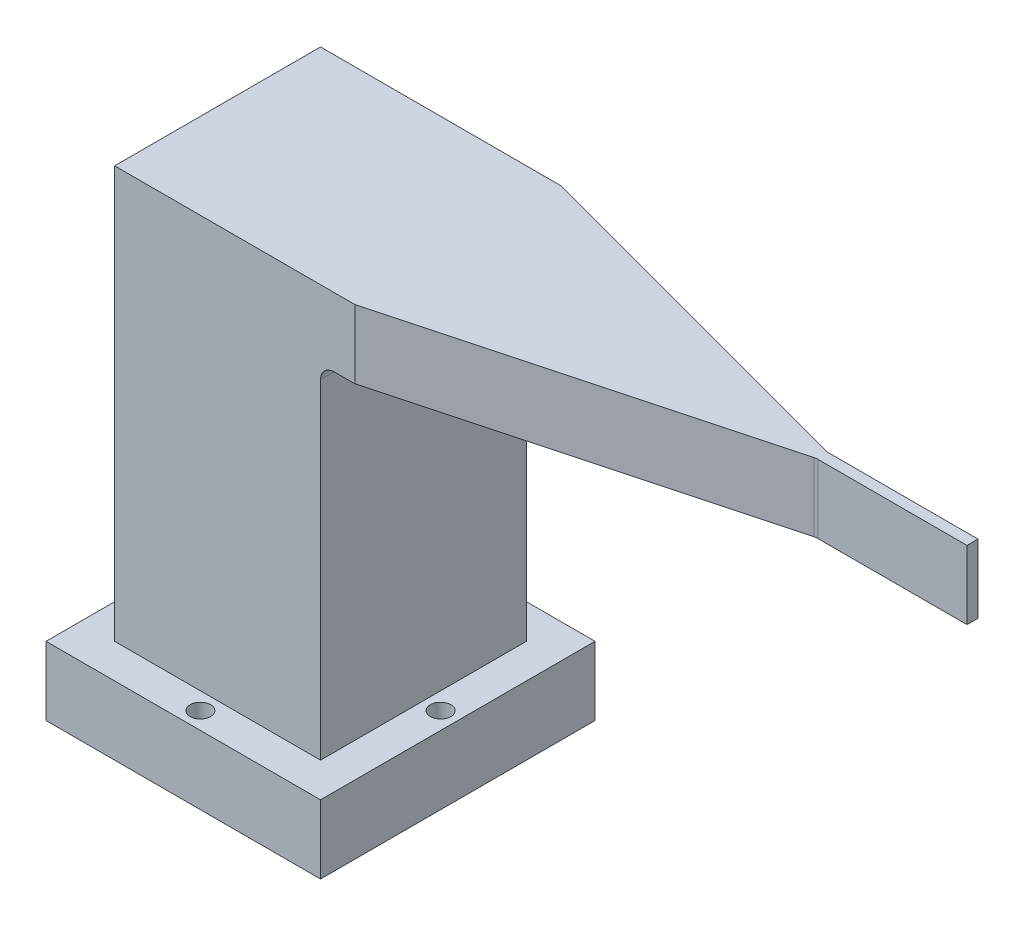
ISO-10303-21;
HEADER;
FILE_DESCRIPTION(('STEP AP214'),'2;1');
FILE_NAME('part.step','',(''),(''),'','','');
FILE_SCHEMA(('AUTOMOTIVE_DESIGN { 1 0 10303 214 1 1 1 1 }'));
ENDSEC;
DATA;
#1=APPLICATION_CONTEXT('core data for automotive mechanical design processes');
#2=APPLICATION_PROTOCOL_DEFINITION('international standard','automotive_design',2000,#1);
#3=PRODUCT_CONTEXT('',#1,'mechanical');
#4=PRODUCT('Part','Part','',(#3));
#5=PRODUCT_RELATED_PRODUCT_CATEGORY('part','',(#4));
#6=PRODUCT_DEFINITION_FORMATION('','',#4);
#7=PRODUCT_DEFINITION_CONTEXT('part definition',#1,'design');
#8=PRODUCT_DEFINITION('design','',#6,#7);
#9=PRODUCT_DEFINITION_SHAPE('','',#8);
#10=(LENGTH_UNIT() NAMED_UNIT(*) SI_UNIT(.MILLI.,.METRE.));
#11=(NAMED_UNIT(*) PLANE_ANGLE_UNIT() SI_UNIT($,.RADIAN.));
#12=(NAMED_UNIT(*) SI_UNIT($,.STERADIAN.) SOLID_ANGLE_UNIT());
#13=UNCERTAINTY_MEASURE_WITH_UNIT(LENGTH_MEASURE(1.E-05),#10,'distance_accuracy_value','');
#14=(GEOMETRIC_REPRESENTATION_CONTEXT(3) GLOBAL_UNCERTAINTY_ASSIGNED_CONTEXT((#13)) GLOBAL_UNIT_ASSIGNED_CONTEXT((#10,
#11,#12)) REPRESENTATION_CONTEXT('',''));
#15=CARTESIAN_POINT('',(0.,0.,0.));
#16=DIRECTION('',(0.,0.,1.));
#17=DIRECTION('',(1.,0.,0.));
#18=AXIS2_PLACEMENT_3D('',#15,#16,#17);
#19=CARTESIAN_POINT('',(7.5,35.,-7.5));
#20=DIRECTION('',(1.,0.,0.));
#21=DIRECTION('',(0.,0.,-1.));
#22=AXIS2_PLACEMENT_3D('',#19,#20,#21);
#23=PLANE('',#22);
#24=DIRECTION('',(0.,-1.,0.));
#25=VECTOR('',#24,1.);
#26=CARTESIAN_POINT('',(7.5,35.,-7.5));
#27=LINE('',#26,#25);
#28=CARTESIAN_POINT('',(7.5,29.,-7.5));
#29=VERTEX_POINT('',#28);
#30=CARTESIAN_POINT('',(7.5,5.,-7.5));
#31=VERTEX_POINT('',#30);
#32=EDGE_CURVE('E193',#29,#31,#27,.T.);
#33=ORIENTED_EDGE('',*,*,#32,.F.);
#34=DIRECTION('',(0.,0.,-1.));
#35=VECTOR('',#34,1.);
#36=CARTESIAN_POINT('',(7.5,29.,-7.5));
#37=LINE('',#36,#35);
#38=CARTESIAN_POINT('',(7.5,29.,7.5));
#39=VERTEX_POINT('',#38);
#40=EDGE_CURVE('E239',#29,#39,#37,.F.);
#41=ORIENTED_EDGE('',*,*,#40,.T.);
#42=DIRECTION('',(0.,-1.,0.));
#43=VECTOR('',#42,1.);
#44=CARTESIAN_POINT('',(7.5,35.,7.5));
#45=LINE('',#44,#43);
#46=CARTESIAN_POINT('',(7.5,5.,7.5));
#47=VERTEX_POINT('',#46);
#48=EDGE_CURVE('E191',#39,#47,#45,.T.);
#49=ORIENTED_EDGE('',*,*,#48,.T.);
#50=DIRECTION('',(0.,0.,-1.));
#51=VECTOR('',#50,1.);
#52=CARTESIAN_POINT('',(7.5,5.,0.));
#53=LINE('',#52,#51);
#54=EDGE_CURVE('E197',#47,#31,#53,.T.);
#55=ORIENTED_EDGE('',*,*,#54,.T.);
#56=EDGE_LOOP('',(#33,#41,#49,#55));
#57=FACE_BOUND('',#56,.T.);
#58=ADVANCED_FACE('F33',(#57),#23,.T.);
#59=CARTESIAN_POINT('',(-10.,5.,10.));
#60=DIRECTION('',(1.,0.,0.));
#61=DIRECTION('',(0.,0.,-1.));
#62=AXIS2_PLACEMENT_3D('',#59,#60,#61);
#63=PLANE('',#62);
#64=DIRECTION('',(0.,0.,1.));
#65=VECTOR('',#64,1.);
#66=CARTESIAN_POINT('',(-10.,0.,10.));
#67=LINE('',#66,#65);
#68=CARTESIAN_POINT('',(-10.,0.,-10.));
#69=VERTEX_POINT('',#68);
#70=CARTESIAN_POINT('',(-10.,0.,10.));
#71=VERTEX_POINT('',#70);
#72=EDGE_CURVE('E206',#69,#71,#67,.T.);
#73=ORIENTED_EDGE('',*,*,#72,.T.);
#74=DIRECTION('',(0.,-1.,0.));
#75=VECTOR('',#74,1.);
#76=CARTESIAN_POINT('',(-10.,5.,10.));
#77=LINE('',#76,#75);
#78=CARTESIAN_POINT('',(-10.,5.,10.));
#79=VERTEX_POINT('',#78);
#80=EDGE_CURVE('E233',#79,#71,#77,.T.);
#81=ORIENTED_EDGE('',*,*,#80,.F.);
#82=DIRECTION('',(0.,0.,1.));
#83=VECTOR('',#82,1.);
#84=CARTESIAN_POINT('',(-10.,5.,10.));
#85=LINE('',#84,#83);
#86=CARTESIAN_POINT('',(-10.,5.,-10.));
#87=VERTEX_POINT('',#86);
#88=EDGE_CURVE('E207',#87,#79,#85,.T.);
#89=ORIENTED_EDGE('',*,*,#88,.F.);
#90=DIRECTION('',(0.,-1.,0.));
#91=VECTOR('',#90,1.);
#92=CARTESIAN_POINT('',(-10.,5.,-10.));
#93=LINE('',#92,#91);
#94=EDGE_CURVE('E217',#87,#69,#93,.T.);
#95=ORIENTED_EDGE('',*,*,#94,.T.);
#96=EDGE_LOOP('',(#73,#81,#89,#95));
#97=FACE_BOUND('',#96,.T.);
#98=ADVANCED_FACE('F281',(#97),#63,.F.);
#99=CARTESIAN_POINT('',(10.,5.,10.));
#100=DIRECTION('',(0.,0.,-1.));
#101=DIRECTION('',(-1.,0.,0.));
#102=AXIS2_PLACEMENT_3D('',#99,#100,#101);
#103=PLANE('',#102);
#104=DIRECTION('',(1.,0.,0.));
#105=VECTOR('',#104,1.);
#106=CARTESIAN_POINT('',(10.,0.,10.));
#107=LINE('',#106,#105);
#108=CARTESIAN_POINT('',(10.,0.,10.));
#109=VERTEX_POINT('',#108);
#110=EDGE_CURVE('E220',#71,#109,#107,.T.);
#111=ORIENTED_EDGE('',*,*,#110,.T.);
#112=DIRECTION('',(0.,-1.,0.));
#113=VECTOR('',#112,1.);
#114=CARTESIAN_POINT('',(10.,5.,10.));
#115=LINE('',#114,#113);
#116=CARTESIAN_POINT('',(10.,5.,10.));
#117=VERTEX_POINT('',#116);
#118=EDGE_CURVE('E230',#117,#109,#115,.T.);
#119=ORIENTED_EDGE('',*,*,#118,.F.);
#120=DIRECTION('',(1.,0.,0.));
#121=VECTOR('',#120,1.);
#122=CARTESIAN_POINT('',(10.,5.,10.));
#123=LINE('',#122,#121);
#124=EDGE_CURVE('E210',#79,#117,#123,.T.);
#125=ORIENTED_EDGE('',*,*,#124,.F.);
#126=ORIENTED_EDGE('',*,*,#80,.T.);
#127=EDGE_LOOP('',(#111,#119,#125,#126));
#128=FACE_BOUND('',#127,.T.);
#129=ADVANCED_FACE('F287',(#128),#103,.F.);
#130=CARTESIAN_POINT('',(10.,5.,10.));
#131=DIRECTION('',(-1.,0.,0.));
#132=DIRECTION('',(0.,0.,1.));
#133=AXIS2_PLACEMENT_3D('',#130,#131,#132);
#134=PLANE('',#133);
#135=DIRECTION('',(0.,0.,-1.));
#136=VECTOR('',#135,1.);
#137=CARTESIAN_POINT('',(10.,0.,10.));
#138=LINE('',#137,#136);
#139=CARTESIAN_POINT('',(10.,0.,-10.));
#140=VERTEX_POINT('',#139);
#141=EDGE_CURVE('E222',#109,#140,#138,.T.);
#142=ORIENTED_EDGE('',*,*,#141,.T.);
#143=DIRECTION('',(0.,-1.,0.));
#144=VECTOR('',#143,1.);
#145=CARTESIAN_POINT('',(10.,5.,-10.));
#146=LINE('',#145,#144);
#147=CARTESIAN_POINT('',(10.,5.,-10.));
#148=VERTEX_POINT('',#147);
#149=EDGE_CURVE('E227',#148,#140,#146,.T.);
#150=ORIENTED_EDGE('',*,*,#149,.F.);
#151=DIRECTION('',(0.,0.,-1.));
#152=VECTOR('',#151,1.);
#153=CARTESIAN_POINT('',(10.,5.,10.));
#154=LINE('',#153,#152);
#155=EDGE_CURVE('E213',#117,#148,#154,.T.);
#156=ORIENTED_EDGE('',*,*,#155,.F.);
#157=ORIENTED_EDGE('',*,*,#118,.T.);
#158=EDGE_LOOP('',(#142,#150,#156,#157));
#159=FACE_BOUND('',#158,.T.);
#160=ADVANCED_FACE('F312',(#159),#134,.F.);
#161=CARTESIAN_POINT('',(10.,5.,-10.));
#162=DIRECTION('',(0.,0.,1.));
#163=DIRECTION('',(1.,0.,0.));
#164=AXIS2_PLACEMENT_3D('',#161,#162,#163);
#165=PLANE('',#164);
#166=DIRECTION('',(-1.,0.,0.));
#167=VECTOR('',#166,1.);
#168=CARTESIAN_POINT('',(10.,0.,-10.));
#169=LINE('',#168,#167);
#170=EDGE_CURVE('E211',#140,#69,#169,.T.);
#171=ORIENTED_EDGE('',*,*,#170,.T.);
#172=ORIENTED_EDGE('',*,*,#94,.F.);
#173=DIRECTION('',(-1.,0.,0.));
#174=VECTOR('',#173,1.);
#175=CARTESIAN_POINT('',(10.,5.,-10.));
#176=LINE('',#175,#174);
#177=EDGE_CURVE('E215',#148,#87,#176,.T.);
#178=ORIENTED_EDGE('',*,*,#177,.F.);
#179=ORIENTED_EDGE('',*,*,#149,.T.);
#180=EDGE_LOOP('',(#171,#172,#178,#179));
#181=FACE_BOUND('',#180,.T.);
#182=ADVANCED_FACE('F305',(#181),#165,.F.);
#183=CARTESIAN_POINT('',(0.,5.,0.));
#184=DIRECTION('',(0.,1.,0.));
#185=DIRECTION('',(0.,0.,1.));
#186=AXIS2_PLACEMENT_3D('',#183,#184,#185);
#187=PLANE('',#186);
#188=CARTESIAN_POINT('',(-8.75,5.,0.));
#189=DIRECTION('',(0.,1.,0.));
#190=DIRECTION('',(0.,0.,1.));
#191=AXIS2_PLACEMENT_3D('',#188,#189,#190);
#192=CIRCLE('',#191,0.75);
#193=CARTESIAN_POINT('',(-8.75,5.,0.75));
#194=VERTEX_POINT('',#193);
#195=EDGE_CURVE('E547',#194,#194,#192,.T.);
#196=ORIENTED_EDGE('',*,*,#195,.F.);
#197=EDGE_LOOP('',(#196));
#198=FACE_BOUND('',#197,.T.);
#199=CARTESIAN_POINT('',(0.,5.,-8.75));
#200=DIRECTION('',(0.,1.,0.));
#201=DIRECTION('',(0.,0.,1.));
#202=AXIS2_PLACEMENT_3D('',#199,#200,#201);
#203=CIRCLE('',#202,0.75);
#204=CARTESIAN_POINT('',(0.,5.,-8.));
#205=VERTEX_POINT('',#204);
#206=EDGE_CURVE('E553',#205,#205,#203,.T.);
#207=ORIENTED_EDGE('',*,*,#206,.F.);
#208=EDGE_LOOP('',(#207));
#209=FACE_BOUND('',#208,.T.);
#210=CARTESIAN_POINT('',(8.75,5.,0.));
#211=DIRECTION('',(0.,1.,0.));
#212=DIRECTION('',(0.,0.,1.));
#213=AXIS2_PLACEMENT_3D('',#210,#211,#212);
#214=CIRCLE('',#213,0.750000000000001);
#215=CARTESIAN_POINT('',(8.75,5.,0.750000000000062));
#216=VERTEX_POINT('',#215);
#217=EDGE_CURVE('E559',#216,#216,#214,.T.);
#218=ORIENTED_EDGE('',*,*,#217,.F.);
#219=EDGE_LOOP('',(#218));
#220=FACE_BOUND('',#219,.T.);
#221=CARTESIAN_POINT('',(0.,5.,8.75));
#222=DIRECTION('',(0.,1.,0.));
#223=DIRECTION('',(0.,0.,1.));
#224=AXIS2_PLACEMENT_3D('',#221,#222,#223);
#225=CIRCLE('',#224,0.75);
#226=CARTESIAN_POINT('',(0.,5.,9.5));
#227=VERTEX_POINT('',#226);
#228=EDGE_CURVE('E546',#227,#227,#225,.T.);
#229=ORIENTED_EDGE('',*,*,#228,.F.);
#230=EDGE_LOOP('',(#229));
#231=FACE_BOUND('',#230,.T.);
#232=DIRECTION('',(0.,0.,1.));
#233=VECTOR('',#232,1.);
#234=CARTESIAN_POINT('',(-7.5,5.,0.));
#235=LINE('',#234,#233);
#236=CARTESIAN_POINT('',(-7.5,5.,-7.5));
#237=VERTEX_POINT('',#236);
#238=CARTESIAN_POINT('',(-7.5,5.,7.5));
#239=VERTEX_POINT('',#238);
#240=EDGE_CURVE('E203',#237,#239,#235,.T.);
#241=ORIENTED_EDGE('',*,*,#240,.F.);
#242=DIRECTION('',(-1.,0.,0.));
#243=VECTOR('',#242,1.);
#244=CARTESIAN_POINT('',(0.,5.,-7.5));
#245=LINE('',#244,#243);
#246=EDGE_CURVE('E190',#31,#237,#245,.T.);
#247=ORIENTED_EDGE('',*,*,#246,.F.);
#248=ORIENTED_EDGE('',*,*,#54,.F.);
#249=DIRECTION('',(1.,0.,0.));
#250=VECTOR('',#249,1.);
#251=CARTESIAN_POINT('',(0.,5.,7.5));
#252=LINE('',#251,#250);
#253=EDGE_CURVE('E200',#239,#47,#252,.T.);
#254=ORIENTED_EDGE('',*,*,#253,.F.);
#255=EDGE_LOOP('',(#241,#247,#248,#254));
#256=FACE_BOUND('',#255,.T.);
#257=ORIENTED_EDGE('',*,*,#88,.T.);
#258=ORIENTED_EDGE('',*,*,#124,.T.);
#259=ORIENTED_EDGE('',*,*,#155,.T.);
#260=ORIENTED_EDGE('',*,*,#177,.T.);
#261=EDGE_LOOP('',(#257,#258,#259,#260));
#262=FACE_BOUND('',#261,.T.);
#263=ADVANCED_FACE('F302',(#198,#209,#220,#231,#256,#262),#187,.T.);
#264=CARTESIAN_POINT('',(0.,0.,0.));
#265=DIRECTION('',(0.,1.,0.));
#266=DIRECTION('',(0.,0.,1.));
#267=AXIS2_PLACEMENT_3D('',#264,#265,#266);
#268=PLANE('',#267);
#269=CARTESIAN_POINT('',(-8.75,0.,0.));
#270=DIRECTION('',(0.,1.,0.));
#271=DIRECTION('',(0.,0.,1.));
#272=AXIS2_PLACEMENT_3D('',#269,#270,#271);
#273=CIRCLE('',#272,0.75);
#274=CARTESIAN_POINT('',(-8.75,0.,0.75));
#275=VERTEX_POINT('',#274);
#276=EDGE_CURVE('E183',#275,#275,#273,.F.);
#277=ORIENTED_EDGE('',*,*,#276,.F.);
#278=EDGE_LOOP('',(#277));
#279=FACE_BOUND('',#278,.T.);
#280=CARTESIAN_POINT('',(0.,0.,-8.75));
#281=DIRECTION('',(0.,1.,0.));
#282=DIRECTION('',(0.,0.,1.));
#283=AXIS2_PLACEMENT_3D('',#280,#281,#282);
#284=CIRCLE('',#283,0.75);
#285=CARTESIAN_POINT('',(0.,0.,-8.));
#286=VERTEX_POINT('',#285);
#287=EDGE_CURVE('E550',#286,#286,#284,.F.);
#288=ORIENTED_EDGE('',*,*,#287,.F.);
#289=EDGE_LOOP('',(#288));
#290=FACE_BOUND('',#289,.T.);
#291=CARTESIAN_POINT('',(8.75,0.,0.));
#292=DIRECTION('',(0.,1.,0.));
#293=DIRECTION('',(0.,0.,1.));
#294=AXIS2_PLACEMENT_3D('',#291,#292,#293);
#295=CIRCLE('',#294,0.750000000000001);
#296=CARTESIAN_POINT('',(8.75,0.,0.750000000000062));
#297=VERTEX_POINT('',#296);
#298=EDGE_CURVE('E556',#297,#297,#295,.F.);
#299=ORIENTED_EDGE('',*,*,#298,.F.);
#300=EDGE_LOOP('',(#299));
#301=FACE_BOUND('',#300,.T.);
#302=CARTESIAN_POINT('',(0.,0.,8.75));
#303=DIRECTION('',(0.,1.,0.));
#304=DIRECTION('',(0.,0.,1.));
#305=AXIS2_PLACEMENT_3D('',#302,#303,#304);
#306=CIRCLE('',#305,0.75);
#307=CARTESIAN_POINT('',(0.,0.,9.5));
#308=VERTEX_POINT('',#307);
#309=EDGE_CURVE('E562',#308,#308,#306,.F.);
#310=ORIENTED_EDGE('',*,*,#309,.F.);
#311=EDGE_LOOP('',(#310));
#312=FACE_BOUND('',#311,.T.);
#313=ORIENTED_EDGE('',*,*,#72,.F.);
#314=ORIENTED_EDGE('',*,*,#170,.F.);
#315=ORIENTED_EDGE('',*,*,#141,.F.);
#316=ORIENTED_EDGE('',*,*,#110,.F.);
#317=EDGE_LOOP('',(#313,#314,#315,#316));
#318=FACE_BOUND('',#317,.T.);
#319=ADVANCED_FACE('F300',(#279,#290,#301,#312,#318),#268,.F.);
#320=CARTESIAN_POINT('',(-7.5,35.,-7.5));
#321=DIRECTION('',(-1.,0.,0.));
#322=DIRECTION('',(0.,0.,1.));
#323=AXIS2_PLACEMENT_3D('',#320,#321,#322);
#324=PLANE('',#323);
#325=DIRECTION('',(0.,-1.,0.));
#326=VECTOR('',#325,1.);
#327=CARTESIAN_POINT('',(-7.5,35.,-7.5));
#328=LINE('',#327,#326);
#329=CARTESIAN_POINT('',(-7.5,35.,-7.5));
#330=VERTEX_POINT('',#329);
#331=EDGE_CURVE('E178',#330,#237,#328,.T.);
#332=ORIENTED_EDGE('',*,*,#331,.T.);
#333=ORIENTED_EDGE('',*,*,#240,.T.);
#334=DIRECTION('',(0.,-1.,0.));
#335=VECTOR('',#334,1.);
#336=CARTESIAN_POINT('',(-7.5,35.,7.5));
#337=LINE('',#336,#335);
#338=CARTESIAN_POINT('',(-7.5,35.,7.5));
#339=VERTEX_POINT('',#338);
#340=EDGE_CURVE('E187',#339,#239,#337,.T.);
#341=ORIENTED_EDGE('',*,*,#340,.F.);
#342=DIRECTION('',(0.,0.,-1.));
#343=VECTOR('',#342,1.);
#344=CARTESIAN_POINT('',(-7.5,35.,-7.5));
#345=LINE('',#344,#343);
#346=EDGE_CURVE('E180',#339,#330,#345,.T.);
#347=ORIENTED_EDGE('',*,*,#346,.T.);
#348=EDGE_LOOP('',(#332,#333,#341,#347));
#349=FACE_BOUND('',#348,.T.);
#350=ADVANCED_FACE('F297',(#349),#324,.T.);
#351=CARTESIAN_POINT('',(7.5,35.,7.5));
#352=DIRECTION('',(0.,0.,1.));
#353=DIRECTION('',(1.,0.,0.));
#354=AXIS2_PLACEMENT_3D('',#351,#352,#353);
#355=PLANE('',#354);
#356=DIRECTION('',(0.,1.,0.));
#357=VECTOR('',#356,1.);
#358=CARTESIAN_POINT('',(10.,-8.16621542673572,7.5));
#359=LINE('',#358,#357);
#360=CARTESIAN_POINT('',(10.,30.,7.5));
#361=VERTEX_POINT('',#360);
#362=CARTESIAN_POINT('',(10.,35.,7.5));
#363=VERTEX_POINT('',#362);
#364=EDGE_CURVE('E522',#361,#363,#359,.T.);
#365=ORIENTED_EDGE('',*,*,#364,.T.);
#366=DIRECTION('',(-1.,0.,0.));
#367=VECTOR('',#366,1.);
#368=CARTESIAN_POINT('',(7.5,35.,7.5));
#369=LINE('',#368,#367);
#370=EDGE_CURVE('E179',#363,#339,#369,.T.);
#371=ORIENTED_EDGE('',*,*,#370,.T.);
#372=ORIENTED_EDGE('',*,*,#340,.T.);
#373=ORIENTED_EDGE('',*,*,#253,.T.);
#374=ORIENTED_EDGE('',*,*,#48,.F.);
#375=CARTESIAN_POINT('',(8.5,29.,7.5));
#376=DIRECTION('',(0.,0.,1.));
#377=DIRECTION('',(1.,0.,0.));
#378=AXIS2_PLACEMENT_3D('',#375,#376,#377);
#379=CIRCLE('',#378,1.);
#380=CARTESIAN_POINT('',(8.5,30.,7.5));
#381=VERTEX_POINT('',#380);
#382=EDGE_CURVE('E252',#39,#381,#379,.F.);
#383=ORIENTED_EDGE('',*,*,#382,.T.);
#384=DIRECTION('',(-1.,0.,0.));
#385=VECTOR('',#384,1.);
#386=CARTESIAN_POINT('',(47.5,30.,7.5));
#387=LINE('',#386,#385);
#388=EDGE_CURVE('E544',#361,#381,#387,.T.);
#389=ORIENTED_EDGE('',*,*,#388,.F.);
#390=EDGE_LOOP('',(#365,#371,#372,#373,#374,#383,#389));
#391=FACE_BOUND('',#390,.T.);
#392=ADVANCED_FACE('F293',(#391),#355,.T.);
#393=CARTESIAN_POINT('',(7.5,35.,-7.5));
#394=DIRECTION('',(0.,0.,-1.));
#395=DIRECTION('',(-1.,0.,0.));
#396=AXIS2_PLACEMENT_3D('',#393,#394,#395);
#397=PLANE('',#396);
#398=DIRECTION('',(0.,1.,0.));
#399=VECTOR('',#398,1.);
#400=CARTESIAN_POINT('',(10.,-8.16621542673572,-7.5));
#401=LINE('',#400,#399);
#402=CARTESIAN_POINT('',(10.,30.,-7.5));
#403=VERTEX_POINT('',#402);
#404=CARTESIAN_POINT('',(10.,35.,-7.5));
#405=VERTEX_POINT('',#404);
#406=EDGE_CURVE('E151',#403,#405,#401,.T.);
#407=ORIENTED_EDGE('',*,*,#406,.F.);
#408=DIRECTION('',(-1.,0.,0.));
#409=VECTOR('',#408,1.);
#410=CARTESIAN_POINT('',(47.5,30.,-7.5));
#411=LINE('',#410,#409);
#412=CARTESIAN_POINT('',(8.5,30.,-7.5));
#413=VERTEX_POINT('',#412);
#414=EDGE_CURVE('E542',#403,#413,#411,.T.);
#415=ORIENTED_EDGE('',*,*,#414,.T.);
#416=CARTESIAN_POINT('',(8.5,29.,-7.5));
#417=DIRECTION('',(0.,0.,-1.));
#418=DIRECTION('',(-1.,0.,0.));
#419=AXIS2_PLACEMENT_3D('',#416,#417,#418);
#420=CIRCLE('',#419,1.);
#421=EDGE_CURVE('E250',#413,#29,#420,.F.);
#422=ORIENTED_EDGE('',*,*,#421,.T.);
#423=ORIENTED_EDGE('',*,*,#32,.T.);
#424=ORIENTED_EDGE('',*,*,#246,.T.);
#425=ORIENTED_EDGE('',*,*,#331,.F.);
#426=DIRECTION('',(1.,0.,0.));
#427=VECTOR('',#426,1.);
#428=CARTESIAN_POINT('',(7.5,35.,-7.5));
#429=LINE('',#428,#427);
#430=EDGE_CURVE('E169',#330,#405,#429,.T.);
#431=ORIENTED_EDGE('',*,*,#430,.T.);
#432=EDGE_LOOP('',(#407,#415,#422,#423,#424,#425,#431));
#433=FACE_BOUND('',#432,.T.);
#434=ADVANCED_FACE('F175',(#433),#397,.T.);
#435=CARTESIAN_POINT('',(0.,35.,0.));
#436=DIRECTION('',(0.,-1.,0.));
#437=DIRECTION('',(0.,0.,-1.));
#438=AXIS2_PLACEMENT_3D('',#435,#436,#437);
#439=PLANE('',#438);
#440=DIRECTION('',(0.,0.,1.));
#441=VECTOR('',#440,1.);
#442=CARTESIAN_POINT('',(47.5,35.,7.5));
#443=LINE('',#442,#441);
#444=CARTESIAN_POINT('',(47.5,35.,-0.4));
#445=VERTEX_POINT('',#444);
#446=CARTESIAN_POINT('',(47.5,35.,0.4));
#447=VERTEX_POINT('',#446);
#448=EDGE_CURVE('E540',#445,#447,#443,.T.);
#449=ORIENTED_EDGE('',*,*,#448,.F.);
#450=DIRECTION('',(1.,0.,0.));
#451=VECTOR('',#450,1.);
#452=CARTESIAN_POINT('',(36.497560733739,35.,-0.4));
#453=LINE('',#452,#451);
#454=CARTESIAN_POINT('',(36.6292132313263,35.,-0.4));
#455=VERTEX_POINT('',#454);
#456=EDGE_CURVE('E163',#455,#445,#453,.T.);
#457=ORIENTED_EDGE('',*,*,#456,.F.);
#458=CARTESIAN_POINT('',(36.6292132313263,35.,-1.4));
#459=DIRECTION('',(0.,-1.,0.));
#460=DIRECTION('',(0.,0.,-1.));
#461=AXIS2_PLACEMENT_3D('',#458,#459,#460);
#462=CIRCLE('',#461,1.);
#463=CARTESIAN_POINT('',(36.3703941862238,35.,-0.434074173710931));
#464=VERTEX_POINT('',#463);
#465=EDGE_CURVE('E172',#455,#464,#462,.T.);
#466=ORIENTED_EDGE('',*,*,#465,.T.);
#467=DIRECTION('',(0.965925826289068,0.,0.258819045102522));
#468=VECTOR('',#467,1.);
#469=CARTESIAN_POINT('',(10.,35.,-7.5));
#470=LINE('',#469,#468);
#471=EDGE_CURVE('E154',#405,#464,#470,.T.);
#472=ORIENTED_EDGE('',*,*,#471,.F.);
#473=ORIENTED_EDGE('',*,*,#430,.F.);
#474=ORIENTED_EDGE('',*,*,#346,.F.);
#475=ORIENTED_EDGE('',*,*,#370,.F.);
#476=DIRECTION('',(-0.965925826289068,0.,0.258819045102522));
#477=VECTOR('',#476,1.);
#478=CARTESIAN_POINT('',(10.,35.,7.5));
#479=LINE('',#478,#477);
#480=CARTESIAN_POINT('',(36.3703941862238,35.,0.434074173710931));
#481=VERTEX_POINT('',#480);
#482=EDGE_CURVE('E523',#481,#363,#479,.T.);
#483=ORIENTED_EDGE('',*,*,#482,.F.);
#484=CARTESIAN_POINT('',(36.6292132313263,35.,1.4));
#485=DIRECTION('',(0.,-1.,0.));
#486=DIRECTION('',(0.,0.,-1.));
#487=AXIS2_PLACEMENT_3D('',#484,#485,#486);
#488=CIRCLE('',#487,1.);
#489=CARTESIAN_POINT('',(36.6292132313263,35.,0.4));
#490=VERTEX_POINT('',#489);
#491=EDGE_CURVE('E41',#481,#490,#488,.T.);
#492=ORIENTED_EDGE('',*,*,#491,.T.);
#493=DIRECTION('',(-1.,0.,0.));
#494=VECTOR('',#493,1.);
#495=CARTESIAN_POINT('',(36.497560733739,35.,0.4));
#496=LINE('',#495,#494);
#497=EDGE_CURVE('E517',#447,#490,#496,.T.);
#498=ORIENTED_EDGE('',*,*,#497,.F.);
#499=EDGE_LOOP('',(#449,#457,#466,#472,#473,#474,#475,#483,#492,#498));
#500=FACE_BOUND('',#499,.T.);
#501=ADVANCED_FACE('F167',(#500),#439,.F.);
#502=CARTESIAN_POINT('',(0.,-2.12132034355964,8.75));
#503=DIRECTION('',(0.,1.,0.));
#504=DIRECTION('',(0.,0.,1.));
#505=AXIS2_PLACEMENT_3D('',#502,#503,#504);
#506=CYLINDRICAL_SURFACE('',#505,0.75);
#507=ORIENTED_EDGE('',*,*,#309,.T.);
#508=EDGE_LOOP('',(#507));
#509=FACE_BOUND('',#508,.T.);
#510=ORIENTED_EDGE('',*,*,#228,.T.);
#511=EDGE_LOOP('',(#510));
#512=FACE_BOUND('',#511,.T.);
#513=ADVANCED_FACE('F372',(#509,#512),#506,.F.);
#514=CARTESIAN_POINT('',(8.75,-2.12132034355964,0.));
#515=DIRECTION('',(0.,1.,0.));
#516=DIRECTION('',(0.,0.,1.));
#517=AXIS2_PLACEMENT_3D('',#514,#515,#516);
#518=CYLINDRICAL_SURFACE('',#517,0.750000000000001);
#519=ORIENTED_EDGE('',*,*,#298,.T.);
#520=EDGE_LOOP('',(#519));
#521=FACE_BOUND('',#520,.T.);
#522=ORIENTED_EDGE('',*,*,#217,.T.);
#523=EDGE_LOOP('',(#522));
#524=FACE_BOUND('',#523,.T.);
#525=ADVANCED_FACE('F378',(#521,#524),#518,.F.);
#526=CARTESIAN_POINT('',(0.,-2.12132034355964,-8.75));
#527=DIRECTION('',(0.,1.,0.));
#528=DIRECTION('',(0.,0.,1.));
#529=AXIS2_PLACEMENT_3D('',#526,#527,#528);
#530=CYLINDRICAL_SURFACE('',#529,0.75);
#531=ORIENTED_EDGE('',*,*,#287,.T.);
#532=EDGE_LOOP('',(#531));
#533=FACE_BOUND('',#532,.T.);
#534=ORIENTED_EDGE('',*,*,#206,.T.);
#535=EDGE_LOOP('',(#534));
#536=FACE_BOUND('',#535,.T.);
#537=ADVANCED_FACE('F386',(#533,#536),#530,.F.);
#538=CARTESIAN_POINT('',(-8.75,-2.12132034355964,0.));
#539=DIRECTION('',(0.,1.,0.));
#540=DIRECTION('',(0.,0.,1.));
#541=AXIS2_PLACEMENT_3D('',#538,#539,#540);
#542=CYLINDRICAL_SURFACE('',#541,0.75);
#543=ORIENTED_EDGE('',*,*,#276,.T.);
#544=EDGE_LOOP('',(#543));
#545=FACE_BOUND('',#544,.T.);
#546=ORIENTED_EDGE('',*,*,#195,.T.);
#547=EDGE_LOOP('',(#546));
#548=FACE_BOUND('',#547,.T.);
#549=ADVANCED_FACE('F394',(#545,#548),#542,.F.);
#550=CARTESIAN_POINT('',(47.5,30.,7.5));
#551=DIRECTION('',(0.,1.,0.));
#552=DIRECTION('',(0.,0.,1.));
#553=AXIS2_PLACEMENT_3D('',#550,#551,#552);
#554=PLANE('',#553);
#555=ORIENTED_EDGE('',*,*,#388,.T.);
#556=DIRECTION('',(0.,0.,-1.));
#557=VECTOR('',#556,1.);
#558=CARTESIAN_POINT('',(8.5,30.,7.5));
#559=LINE('',#558,#557);
#560=EDGE_CURVE('E236',#381,#413,#559,.T.);
#561=ORIENTED_EDGE('',*,*,#560,.T.);
#562=ORIENTED_EDGE('',*,*,#414,.F.);
#563=DIRECTION('',(-0.965925826289068,0.,-0.258819045102522));
#564=VECTOR('',#563,1.);
#565=CARTESIAN_POINT('',(10.,30.,-7.5));
#566=LINE('',#565,#564);
#567=CARTESIAN_POINT('',(36.3703941862238,30.,-0.434074173710931));
#568=VERTEX_POINT('',#567);
#569=EDGE_CURVE('E157',#568,#403,#566,.T.);
#570=ORIENTED_EDGE('',*,*,#569,.F.);
#571=CARTESIAN_POINT('',(36.6292132313263,30.,-1.4));
#572=DIRECTION('',(0.,1.,0.));
#573=DIRECTION('',(0.,0.,1.));
#574=AXIS2_PLACEMENT_3D('',#571,#572,#573);
#575=CIRCLE('',#574,1.);
#576=CARTESIAN_POINT('',(36.6292132313263,30.,-0.4));
#577=VERTEX_POINT('',#576);
#578=EDGE_CURVE('E255',#568,#577,#575,.T.);
#579=ORIENTED_EDGE('',*,*,#578,.T.);
#580=DIRECTION('',(-1.,0.,0.));
#581=VECTOR('',#580,1.);
#582=CARTESIAN_POINT('',(36.497560733739,30.,-0.4));
#583=LINE('',#582,#581);
#584=CARTESIAN_POINT('',(47.5,30.,-0.4));
#585=VERTEX_POINT('',#584);
#586=EDGE_CURVE('E263',#585,#577,#583,.T.);
#587=ORIENTED_EDGE('',*,*,#586,.F.);
#588=DIRECTION('',(0.,0.,-1.));
#589=VECTOR('',#588,1.);
#590=CARTESIAN_POINT('',(47.5,30.,7.5));
#591=LINE('',#590,#589);
#592=CARTESIAN_POINT('',(47.5,30.,0.4));
#593=VERTEX_POINT('',#592);
#594=EDGE_CURVE('E538',#593,#585,#591,.T.);
#595=ORIENTED_EDGE('',*,*,#594,.F.);
#596=DIRECTION('',(1.,0.,0.));
#597=VECTOR('',#596,1.);
#598=CARTESIAN_POINT('',(36.497560733739,30.,0.4));
#599=LINE('',#598,#597);
#600=CARTESIAN_POINT('',(36.6292132313263,30.,0.4));
#601=VERTEX_POINT('',#600);
#602=EDGE_CURVE('E529',#601,#593,#599,.T.);
#603=ORIENTED_EDGE('',*,*,#602,.F.);
#604=CARTESIAN_POINT('',(36.6292132313263,30.,1.4));
#605=DIRECTION('',(0.,1.,0.));
#606=DIRECTION('',(0.,0.,1.));
#607=AXIS2_PLACEMENT_3D('',#604,#605,#606);
#608=CIRCLE('',#607,1.);
#609=CARTESIAN_POINT('',(36.3703941862238,30.,0.434074173710931));
#610=VERTEX_POINT('',#609);
#611=EDGE_CURVE('E11',#601,#610,#608,.T.);
#612=ORIENTED_EDGE('',*,*,#611,.T.);
#613=DIRECTION('',(0.965925826289068,0.,-0.258819045102522));
#614=VECTOR('',#613,1.);
#615=CARTESIAN_POINT('',(10.,30.,7.5));
#616=LINE('',#615,#614);
#617=EDGE_CURVE('E173',#361,#610,#616,.T.);
#618=ORIENTED_EDGE('',*,*,#617,.F.);
#619=EDGE_LOOP('',(#555,#561,#562,#570,#579,#587,#595,#603,#612,#618));
#620=FACE_BOUND('',#619,.T.);
#621=ADVANCED_FACE('F261',(#620),#554,.F.);
#622=CARTESIAN_POINT('',(47.5,0.,0.));
#623=DIRECTION('',(1.,0.,0.));
#624=DIRECTION('',(0.,0.,-1.));
#625=AXIS2_PLACEMENT_3D('',#622,#623,#624);
#626=PLANE('',#625);
#627=DIRECTION('',(0.,1.,0.));
#628=VECTOR('',#627,1.);
#629=CARTESIAN_POINT('',(47.5,-8.16621542673572,-0.4));
#630=LINE('',#629,#628);
#631=EDGE_CURVE('E162',#585,#445,#630,.T.);
#632=ORIENTED_EDGE('',*,*,#631,.T.);
#633=ORIENTED_EDGE('',*,*,#448,.T.);
#634=DIRECTION('',(0.,1.,0.));
#635=VECTOR('',#634,1.);
#636=CARTESIAN_POINT('',(47.5,-8.16621542673572,0.4));
#637=LINE('',#636,#635);
#638=EDGE_CURVE('E520',#593,#447,#637,.T.);
#639=ORIENTED_EDGE('',*,*,#638,.F.);
#640=ORIENTED_EDGE('',*,*,#594,.T.);
#641=EDGE_LOOP('',(#632,#633,#639,#640));
#642=FACE_BOUND('',#641,.T.);
#643=ADVANCED_FACE('F409',(#642),#626,.T.);
#644=CARTESIAN_POINT('',(10.,-8.16621542673572,7.5));
#645=DIRECTION('',(-0.258819045102522,0.,-0.965925826289068));
#646=DIRECTION('',(-0.965925826289068,0.,0.258819045102522));
#647=AXIS2_PLACEMENT_3D('',#644,#645,#646);
#648=PLANE('',#647);
#649=ORIENTED_EDGE('',*,*,#617,.T.);
#650=DIRECTION('',(0.,1.,0.));
#651=VECTOR('',#650,1.);
#652=CARTESIAN_POINT('',(36.3703941862238,35.,0.434074173710933));
#653=LINE('',#652,#651);
#654=EDGE_CURVE('E246',#610,#481,#653,.T.);
#655=ORIENTED_EDGE('',*,*,#654,.T.);
#656=ORIENTED_EDGE('',*,*,#482,.T.);
#657=ORIENTED_EDGE('',*,*,#364,.F.);
#658=EDGE_LOOP('',(#649,#655,#656,#657));
#659=FACE_BOUND('',#658,.T.);
#660=ADVANCED_FACE('F416',(#659),#648,.F.);
#661=CARTESIAN_POINT('',(36.497560733739,-8.16621542673572,0.4));
#662=DIRECTION('',(0.,0.,-1.));
#663=DIRECTION('',(-1.,0.,0.));
#664=AXIS2_PLACEMENT_3D('',#661,#662,#663);
#665=PLANE('',#664);
#666=ORIENTED_EDGE('',*,*,#497,.T.);
#667=DIRECTION('',(0.,1.,0.));
#668=VECTOR('',#667,1.);
#669=CARTESIAN_POINT('',(36.6292132313263,30.,0.4));
#670=LINE('',#669,#668);
#671=EDGE_CURVE('E248',#490,#601,#670,.F.);
#672=ORIENTED_EDGE('',*,*,#671,.T.);
#673=ORIENTED_EDGE('',*,*,#602,.T.);
#674=ORIENTED_EDGE('',*,*,#638,.T.);
#675=EDGE_LOOP('',(#666,#672,#673,#674));
#676=FACE_BOUND('',#675,.T.);
#677=ADVANCED_FACE('F423',(#676),#665,.F.);
#678=CARTESIAN_POINT('',(36.497560733739,-8.16621542673572,-0.4));
#679=DIRECTION('',(0.,0.,1.));
#680=DIRECTION('',(1.,0.,0.));
#681=AXIS2_PLACEMENT_3D('',#678,#679,#680);
#682=PLANE('',#681);
#683=ORIENTED_EDGE('',*,*,#586,.T.);
#684=DIRECTION('',(0.,1.,0.));
#685=VECTOR('',#684,1.);
#686=CARTESIAN_POINT('',(36.6292132313263,35.,-0.4));
#687=LINE('',#686,#685);
#688=EDGE_CURVE('E241',#577,#455,#687,.T.);
#689=ORIENTED_EDGE('',*,*,#688,.T.);
#690=ORIENTED_EDGE('',*,*,#456,.T.);
#691=ORIENTED_EDGE('',*,*,#631,.F.);
#692=EDGE_LOOP('',(#683,#689,#690,#691));
#693=FACE_BOUND('',#692,.T.);
#694=ADVANCED_FACE('F268',(#693),#682,.F.);
#695=CARTESIAN_POINT('',(10.,-8.16621542673572,-7.5));
#696=DIRECTION('',(-0.258819045102522,0.,0.965925826289068));
#697=DIRECTION('',(0.965925826289068,0.,0.258819045102522));
#698=AXIS2_PLACEMENT_3D('',#695,#696,#697);
#699=PLANE('',#698);
#700=ORIENTED_EDGE('',*,*,#471,.T.);
#701=DIRECTION('',(0.,1.,0.));
#702=VECTOR('',#701,1.);
#703=CARTESIAN_POINT('',(36.3703941862238,30.,-0.434074173710933));
#704=LINE('',#703,#702);
#705=EDGE_CURVE('E244',#464,#568,#704,.F.);
#706=ORIENTED_EDGE('',*,*,#705,.T.);
#707=ORIENTED_EDGE('',*,*,#569,.T.);
#708=ORIENTED_EDGE('',*,*,#406,.T.);
#709=EDGE_LOOP('',(#700,#706,#707,#708));
#710=FACE_BOUND('',#709,.T.);
#711=ADVANCED_FACE('F153',(#710),#699,.F.);
#712=CARTESIAN_POINT('',(8.5,29.,7.5));
#713=DIRECTION('',(0.,0.,-1.));
#714=DIRECTION('',(-1.,0.,0.));
#715=AXIS2_PLACEMENT_3D('',#712,#713,#714);
#716=CYLINDRICAL_SURFACE('',#715,1.);
#717=ORIENTED_EDGE('',*,*,#382,.F.);
#718=ORIENTED_EDGE('',*,*,#40,.F.);
#719=ORIENTED_EDGE('',*,*,#421,.F.);
#720=ORIENTED_EDGE('',*,*,#560,.F.);
#721=EDGE_LOOP('',(#717,#718,#719,#720));
#722=FACE_BOUND('',#721,.T.);
#723=ADVANCED_FACE('F273',(#722),#716,.F.);
#724=CARTESIAN_POINT('',(36.6292132313263,-8.16621542673572,-1.4));
#725=DIRECTION('',(0.,-1.,0.));
#726=DIRECTION('',(0.,0.,-1.));
#727=AXIS2_PLACEMENT_3D('',#724,#725,#726);
#728=CYLINDRICAL_SURFACE('',#727,1.);
#729=ORIENTED_EDGE('',*,*,#578,.F.);
#730=ORIENTED_EDGE('',*,*,#705,.F.);
#731=ORIENTED_EDGE('',*,*,#465,.F.);
#732=ORIENTED_EDGE('',*,*,#688,.F.);
#733=EDGE_LOOP('',(#729,#730,#731,#732));
#734=FACE_BOUND('',#733,.T.);
#735=ADVANCED_FACE('F271',(#734),#728,.F.);
#736=CARTESIAN_POINT('',(36.6292132313263,-8.16621542673572,1.4));
#737=DIRECTION('',(0.,-1.,0.));
#738=DIRECTION('',(0.,0.,-1.));
#739=AXIS2_PLACEMENT_3D('',#736,#737,#738);
#740=CYLINDRICAL_SURFACE('',#739,1.);
#741=ORIENTED_EDGE('',*,*,#611,.F.);
#742=ORIENTED_EDGE('',*,*,#671,.F.);
#743=ORIENTED_EDGE('',*,*,#491,.F.);
#744=ORIENTED_EDGE('',*,*,#654,.F.);
#745=EDGE_LOOP('',(#741,#742,#743,#744));
#746=FACE_BOUND('',#745,.T.);
#747=ADVANCED_FACE('F35',(#746),#740,.F.);
#748=CLOSED_SHELL('',(#58,#98,#129,#160,#182,#263,#319,#350,#392,#434,#501,#513,#525,#537,#549,
#621,#643,#660,#677,#694,#711,#723,#735,#747));
#749=MANIFOLD_SOLID_BREP('B2',#748);
#750=ADVANCED_BREP_SHAPE_REPRESENTATION('',(#18,#749),#14);
#751=SHAPE_DEFINITION_REPRESENTATION(#9,#750);
ENDSEC;
END-ISO-10303-21;
